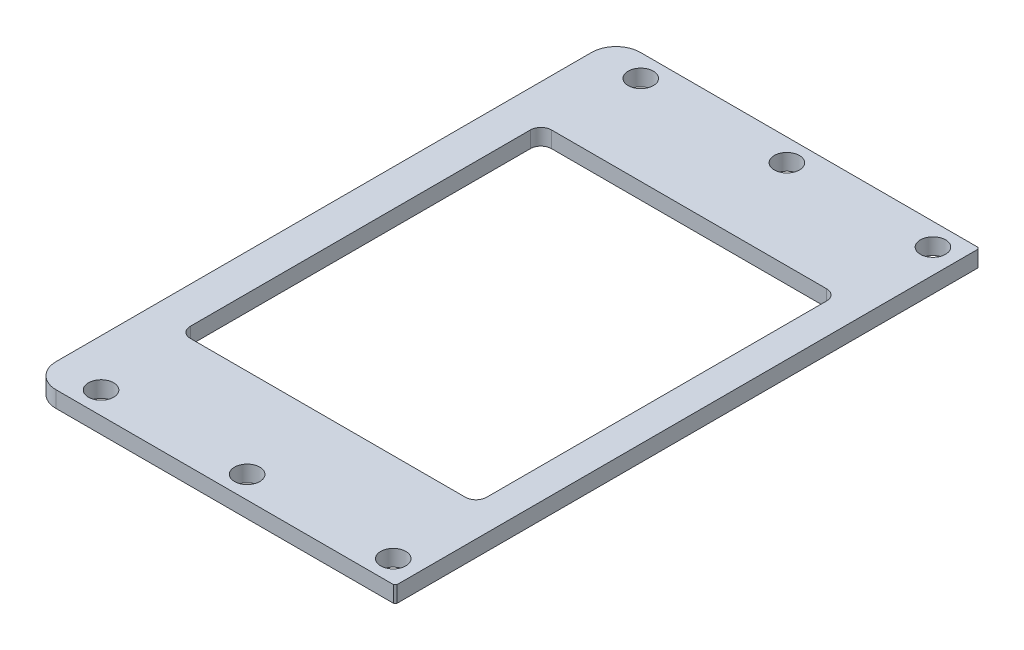
ISO-10303-21;
HEADER;
FILE_DESCRIPTION(('STEP AP214'),'2;1');
FILE_NAME('part.step','',(''),(''),'','','');
FILE_SCHEMA(('AUTOMOTIVE_DESIGN { 1 0 10303 214 1 1 1 1 }'));
ENDSEC;
DATA;
#1=APPLICATION_CONTEXT('core data for automotive mechanical design processes');
#2=APPLICATION_PROTOCOL_DEFINITION('international standard','automotive_design',2000,#1);
#3=PRODUCT_CONTEXT('',#1,'mechanical');
#4=PRODUCT('Part','Part','',(#3));
#5=PRODUCT_RELATED_PRODUCT_CATEGORY('part','',(#4));
#6=PRODUCT_DEFINITION_FORMATION('','',#4);
#7=PRODUCT_DEFINITION_CONTEXT('part definition',#1,'design');
#8=PRODUCT_DEFINITION('design','',#6,#7);
#9=PRODUCT_DEFINITION_SHAPE('','',#8);
#10=(LENGTH_UNIT() NAMED_UNIT(*) SI_UNIT(.MILLI.,.METRE.));
#11=(NAMED_UNIT(*) PLANE_ANGLE_UNIT() SI_UNIT($,.RADIAN.));
#12=(NAMED_UNIT(*) SI_UNIT($,.STERADIAN.) SOLID_ANGLE_UNIT());
#13=UNCERTAINTY_MEASURE_WITH_UNIT(LENGTH_MEASURE(1.E-05),#10,'distance_accuracy_value','');
#14=(GEOMETRIC_REPRESENTATION_CONTEXT(3) GLOBAL_UNCERTAINTY_ASSIGNED_CONTEXT((#13)) GLOBAL_UNIT_ASSIGNED_CONTEXT((#10,
#11,#12)) REPRESENTATION_CONTEXT('',''));
#15=CARTESIAN_POINT('',(0.,0.,0.));
#16=DIRECTION('',(0.,0.,1.));
#17=DIRECTION('',(1.,0.,0.));
#18=AXIS2_PLACEMENT_3D('',#15,#16,#17);
#19=CARTESIAN_POINT('',(-16.6,2.,-20.95));
#20=DIRECTION('',(0.,-1.,0.));
#21=DIRECTION('',(0.,0.,-1.));
#22=AXIS2_PLACEMENT_3D('',#19,#20,#21);
#23=CYLINDRICAL_SURFACE('',#22,1.3);
#24=CARTESIAN_POINT('',(-16.6,0.,-20.95));
#25=DIRECTION('',(0.,1.,0.));
#26=DIRECTION('',(0.,0.,1.));
#27=AXIS2_PLACEMENT_3D('',#24,#25,#26);
#28=CIRCLE('',#27,1.3);
#29=CARTESIAN_POINT('',(-16.6,0.,-22.25));
#30=VERTEX_POINT('',#29);
#31=CARTESIAN_POINT('',(-17.9,0.,-20.95));
#32=VERTEX_POINT('',#31);
#33=EDGE_CURVE('E155',#30,#32,#28,.T.);
#34=ORIENTED_EDGE('',*,*,#33,.F.);
#35=DIRECTION('',(0.,-1.,0.));
#36=VECTOR('',#35,1.);
#37=CARTESIAN_POINT('',(-16.6,2.,-22.25));
#38=LINE('',#37,#36);
#39=CARTESIAN_POINT('',(-16.6,2.,-22.25));
#40=VERTEX_POINT('',#39);
#41=EDGE_CURVE('E151',#40,#30,#38,.T.);
#42=ORIENTED_EDGE('',*,*,#41,.F.);
#43=CARTESIAN_POINT('',(-16.6,2.,-20.95));
#44=DIRECTION('',(0.,1.,0.));
#45=DIRECTION('',(0.,0.,1.));
#46=AXIS2_PLACEMENT_3D('',#43,#44,#45);
#47=CIRCLE('',#46,1.3);
#48=CARTESIAN_POINT('',(-17.9,2.,-20.95));
#49=VERTEX_POINT('',#48);
#50=EDGE_CURVE('E153',#40,#49,#47,.T.);
#51=ORIENTED_EDGE('',*,*,#50,.T.);
#52=DIRECTION('',(0.,-1.,0.));
#53=VECTOR('',#52,1.);
#54=CARTESIAN_POINT('',(-17.9,2.,-20.95));
#55=LINE('',#54,#53);
#56=EDGE_CURVE('E208',#49,#32,#55,.T.);
#57=ORIENTED_EDGE('',*,*,#56,.T.);
#58=EDGE_LOOP('',(#34,#42,#51,#57));
#59=FACE_BOUND('',#58,.T.);
#60=ADVANCED_FACE('F36',(#59),#23,.F.);
#61=CARTESIAN_POINT('',(0.,2.,-22.25));
#62=DIRECTION('',(0.,0.,1.));
#63=DIRECTION('',(1.,0.,0.));
#64=AXIS2_PLACEMENT_3D('',#61,#62,#63);
#65=PLANE('',#64);
#66=DIRECTION('',(-1.,0.,0.));
#67=VECTOR('',#66,1.);
#68=CARTESIAN_POINT('',(0.,0.,-22.25));
#69=LINE('',#68,#67);
#70=CARTESIAN_POINT('',(17.3,0.,-22.25));
#71=VERTEX_POINT('',#70);
#72=EDGE_CURVE('E223',#71,#30,#69,.T.);
#73=ORIENTED_EDGE('',*,*,#72,.F.);
#74=DIRECTION('',(0.,-1.,0.));
#75=VECTOR('',#74,1.);
#76=CARTESIAN_POINT('',(17.3,2.,-22.25));
#77=LINE('',#76,#75);
#78=CARTESIAN_POINT('',(17.3,2.,-22.25));
#79=VERTEX_POINT('',#78);
#80=EDGE_CURVE('E161',#79,#71,#77,.T.);
#81=ORIENTED_EDGE('',*,*,#80,.F.);
#82=DIRECTION('',(-1.,0.,0.));
#83=VECTOR('',#82,1.);
#84=CARTESIAN_POINT('',(0.,2.,-22.25));
#85=LINE('',#84,#83);
#86=EDGE_CURVE('E168',#79,#40,#85,.T.);
#87=ORIENTED_EDGE('',*,*,#86,.T.);
#88=ORIENTED_EDGE('',*,*,#41,.T.);
#89=EDGE_LOOP('',(#73,#81,#87,#88));
#90=FACE_BOUND('',#89,.T.);
#91=ADVANCED_FACE('F175',(#90),#65,.T.);
#92=CARTESIAN_POINT('',(17.3,2.,-20.95));
#93=DIRECTION('',(0.,-1.,0.));
#94=DIRECTION('',(0.,0.,-1.));
#95=AXIS2_PLACEMENT_3D('',#92,#93,#94);
#96=CYLINDRICAL_SURFACE('',#95,1.3);
#97=CARTESIAN_POINT('',(17.3,0.,-20.95));
#98=DIRECTION('',(0.,1.,0.));
#99=DIRECTION('',(0.,0.,1.));
#100=AXIS2_PLACEMENT_3D('',#97,#98,#99);
#101=CIRCLE('',#100,1.3);
#102=CARTESIAN_POINT('',(18.6,0.,-20.95));
#103=VERTEX_POINT('',#102);
#104=EDGE_CURVE('E225',#103,#71,#101,.T.);
#105=ORIENTED_EDGE('',*,*,#104,.F.);
#106=DIRECTION('',(0.,-1.,0.));
#107=VECTOR('',#106,1.);
#108=CARTESIAN_POINT('',(18.6,2.,-20.95));
#109=LINE('',#108,#107);
#110=CARTESIAN_POINT('',(18.6,2.,-20.95));
#111=VERTEX_POINT('',#110);
#112=EDGE_CURVE('E270',#111,#103,#109,.T.);
#113=ORIENTED_EDGE('',*,*,#112,.F.);
#114=CARTESIAN_POINT('',(17.3,2.,-20.95));
#115=DIRECTION('',(0.,1.,0.));
#116=DIRECTION('',(0.,0.,1.));
#117=AXIS2_PLACEMENT_3D('',#114,#115,#116);
#118=CIRCLE('',#117,1.3);
#119=EDGE_CURVE('E176',#111,#79,#118,.T.);
#120=ORIENTED_EDGE('',*,*,#119,.T.);
#121=ORIENTED_EDGE('',*,*,#80,.T.);
#122=EDGE_LOOP('',(#105,#113,#120,#121));
#123=FACE_BOUND('',#122,.T.);
#124=ADVANCED_FACE('F349',(#123),#96,.F.);
#125=CARTESIAN_POINT('',(18.6,2.,0.));
#126=DIRECTION('',(-1.,0.,0.));
#127=DIRECTION('',(0.,0.,1.));
#128=AXIS2_PLACEMENT_3D('',#125,#126,#127);
#129=PLANE('',#128);
#130=DIRECTION('',(0.,0.,-1.));
#131=VECTOR('',#130,1.);
#132=CARTESIAN_POINT('',(18.6,0.,0.));
#133=LINE('',#132,#131);
#134=CARTESIAN_POINT('',(18.6,0.,20.95));
#135=VERTEX_POINT('',#134);
#136=EDGE_CURVE('E228',#135,#103,#133,.T.);
#137=ORIENTED_EDGE('',*,*,#136,.F.);
#138=DIRECTION('',(0.,-1.,0.));
#139=VECTOR('',#138,1.);
#140=CARTESIAN_POINT('',(18.6,2.,20.95));
#141=LINE('',#140,#139);
#142=CARTESIAN_POINT('',(18.6,2.,20.95));
#143=VERTEX_POINT('',#142);
#144=EDGE_CURVE('E268',#143,#135,#141,.T.);
#145=ORIENTED_EDGE('',*,*,#144,.F.);
#146=DIRECTION('',(0.,0.,-1.));
#147=VECTOR('',#146,1.);
#148=CARTESIAN_POINT('',(18.6,2.,0.));
#149=LINE('',#148,#147);
#150=EDGE_CURVE('E178',#143,#111,#149,.T.);
#151=ORIENTED_EDGE('',*,*,#150,.T.);
#152=ORIENTED_EDGE('',*,*,#112,.T.);
#153=EDGE_LOOP('',(#137,#145,#151,#152));
#154=FACE_BOUND('',#153,.T.);
#155=ADVANCED_FACE('F524',(#154),#129,.T.);
#156=CARTESIAN_POINT('',(17.3,2.,20.95));
#157=DIRECTION('',(0.,-1.,0.));
#158=DIRECTION('',(0.,0.,-1.));
#159=AXIS2_PLACEMENT_3D('',#156,#157,#158);
#160=CYLINDRICAL_SURFACE('',#159,1.3);
#161=CARTESIAN_POINT('',(17.3,0.,20.95));
#162=DIRECTION('',(0.,1.,0.));
#163=DIRECTION('',(0.,0.,1.));
#164=AXIS2_PLACEMENT_3D('',#161,#162,#163);
#165=CIRCLE('',#164,1.3);
#166=CARTESIAN_POINT('',(17.3,0.,22.25));
#167=VERTEX_POINT('',#166);
#168=EDGE_CURVE('E231',#167,#135,#165,.T.);
#169=ORIENTED_EDGE('',*,*,#168,.F.);
#170=DIRECTION('',(0.,-1.,0.));
#171=VECTOR('',#170,1.);
#172=CARTESIAN_POINT('',(17.3,2.,22.25));
#173=LINE('',#172,#171);
#174=CARTESIAN_POINT('',(17.3,2.,22.25));
#175=VERTEX_POINT('',#174);
#176=EDGE_CURVE('E266',#175,#167,#173,.T.);
#177=ORIENTED_EDGE('',*,*,#176,.F.);
#178=CARTESIAN_POINT('',(17.3,2.,20.95));
#179=DIRECTION('',(0.,1.,0.));
#180=DIRECTION('',(0.,0.,1.));
#181=AXIS2_PLACEMENT_3D('',#178,#179,#180);
#182=CIRCLE('',#181,1.3);
#183=EDGE_CURVE('E184',#175,#143,#182,.T.);
#184=ORIENTED_EDGE('',*,*,#183,.T.);
#185=ORIENTED_EDGE('',*,*,#144,.T.);
#186=EDGE_LOOP('',(#169,#177,#184,#185));
#187=FACE_BOUND('',#186,.T.);
#188=ADVANCED_FACE('F514',(#187),#160,.F.);
#189=CARTESIAN_POINT('',(0.,2.,22.25));
#190=DIRECTION('',(0.,0.,1.));
#191=DIRECTION('',(1.,0.,0.));
#192=AXIS2_PLACEMENT_3D('',#189,#190,#191);
#193=PLANE('',#192);
#194=DIRECTION('',(-1.,0.,0.));
#195=VECTOR('',#194,1.);
#196=CARTESIAN_POINT('',(0.,0.,22.25));
#197=LINE('',#196,#195);
#198=CARTESIAN_POINT('',(-16.6,0.,22.25));
#199=VERTEX_POINT('',#198);
#200=EDGE_CURVE('E234',#167,#199,#197,.T.);
#201=ORIENTED_EDGE('',*,*,#200,.T.);
#202=DIRECTION('',(0.,-1.,0.));
#203=VECTOR('',#202,1.);
#204=CARTESIAN_POINT('',(-16.6,2.,22.25));
#205=LINE('',#204,#203);
#206=CARTESIAN_POINT('',(-16.6,2.,22.25));
#207=VERTEX_POINT('',#206);
#208=EDGE_CURVE('E263',#207,#199,#205,.T.);
#209=ORIENTED_EDGE('',*,*,#208,.F.);
#210=DIRECTION('',(-1.,0.,0.));
#211=VECTOR('',#210,1.);
#212=CARTESIAN_POINT('',(0.,2.,22.25));
#213=LINE('',#212,#211);
#214=EDGE_CURVE('E187',#175,#207,#213,.T.);
#215=ORIENTED_EDGE('',*,*,#214,.F.);
#216=ORIENTED_EDGE('',*,*,#176,.T.);
#217=EDGE_LOOP('',(#201,#209,#215,#216));
#218=FACE_BOUND('',#217,.T.);
#219=ADVANCED_FACE('F506',(#218),#193,.F.);
#220=CARTESIAN_POINT('',(-16.6,2.,20.95));
#221=DIRECTION('',(0.,-1.,0.));
#222=DIRECTION('',(0.,0.,-1.));
#223=AXIS2_PLACEMENT_3D('',#220,#221,#222);
#224=CYLINDRICAL_SURFACE('',#223,1.3);
#225=CARTESIAN_POINT('',(-16.6,0.,20.95));
#226=DIRECTION('',(0.,1.,0.));
#227=DIRECTION('',(0.,0.,1.));
#228=AXIS2_PLACEMENT_3D('',#225,#226,#227);
#229=CIRCLE('',#228,1.3);
#230=CARTESIAN_POINT('',(-17.9,0.,20.95));
#231=VERTEX_POINT('',#230);
#232=EDGE_CURVE('E237',#199,#231,#229,.F.);
#233=ORIENTED_EDGE('',*,*,#232,.T.);
#234=DIRECTION('',(0.,-1.,0.));
#235=VECTOR('',#234,1.);
#236=CARTESIAN_POINT('',(-17.9,2.,20.95));
#237=LINE('',#236,#235);
#238=CARTESIAN_POINT('',(-17.9,2.,20.95));
#239=VERTEX_POINT('',#238);
#240=EDGE_CURVE('E260',#239,#231,#237,.T.);
#241=ORIENTED_EDGE('',*,*,#240,.F.);
#242=CARTESIAN_POINT('',(-16.6,2.,20.95));
#243=DIRECTION('',(0.,1.,0.));
#244=DIRECTION('',(0.,0.,1.));
#245=AXIS2_PLACEMENT_3D('',#242,#243,#244);
#246=CIRCLE('',#245,1.3);
#247=EDGE_CURVE('E190',#207,#239,#246,.F.);
#248=ORIENTED_EDGE('',*,*,#247,.F.);
#249=ORIENTED_EDGE('',*,*,#208,.T.);
#250=EDGE_LOOP('',(#233,#241,#248,#249));
#251=FACE_BOUND('',#250,.T.);
#252=ADVANCED_FACE('F364',(#251),#224,.F.);
#253=CARTESIAN_POINT('',(0.,2.,36.));
#254=DIRECTION('',(0.,0.,-1.));
#255=DIRECTION('',(-1.,0.,0.));
#256=AXIS2_PLACEMENT_3D('',#253,#254,#255);
#257=PLANE('',#256);
#258=DIRECTION('',(1.,0.,0.));
#259=VECTOR('',#258,1.);
#260=CARTESIAN_POINT('',(0.,2.,36.));
#261=LINE('',#260,#259);
#262=CARTESIAN_POINT('',(-19.4,2.,36.));
#263=VERTEX_POINT('',#262);
#264=CARTESIAN_POINT('',(22.2,2.,36.));
#265=VERTEX_POINT('',#264);
#266=EDGE_CURVE('E338',#263,#265,#261,.T.);
#267=ORIENTED_EDGE('',*,*,#266,.F.);
#268=DIRECTION('',(0.,-1.,0.));
#269=VECTOR('',#268,1.);
#270=CARTESIAN_POINT('',(-19.4,0.,36.));
#271=LINE('',#270,#269);
#272=CARTESIAN_POINT('',(-19.4,0.,36.));
#273=VERTEX_POINT('',#272);
#274=EDGE_CURVE('E11',#263,#273,#271,.T.);
#275=ORIENTED_EDGE('',*,*,#274,.T.);
#276=DIRECTION('',(1.,0.,0.));
#277=VECTOR('',#276,1.);
#278=CARTESIAN_POINT('',(0.,0.,36.));
#279=LINE('',#278,#277);
#280=CARTESIAN_POINT('',(22.2,0.,36.));
#281=VERTEX_POINT('',#280);
#282=EDGE_CURVE('E212',#273,#281,#279,.T.);
#283=ORIENTED_EDGE('',*,*,#282,.T.);
#284=DIRECTION('',(0.,1.,0.));
#285=VECTOR('',#284,1.);
#286=CARTESIAN_POINT('',(22.2,2.,36.));
#287=LINE('',#286,#285);
#288=EDGE_CURVE('E290',#281,#265,#287,.T.);
#289=ORIENTED_EDGE('',*,*,#288,.T.);
#290=EDGE_LOOP('',(#267,#275,#283,#289));
#291=FACE_BOUND('',#290,.T.);
#292=ADVANCED_FACE('F336',(#291),#257,.F.);
#293=CARTESIAN_POINT('',(22.4,2.,0.));
#294=DIRECTION('',(-1.,0.,0.));
#295=DIRECTION('',(0.,0.,1.));
#296=AXIS2_PLACEMENT_3D('',#293,#294,#295);
#297=PLANE('',#296);
#298=DIRECTION('',(0.,0.,-1.));
#299=VECTOR('',#298,1.);
#300=CARTESIAN_POINT('',(22.4,0.,0.));
#301=LINE('',#300,#299);
#302=CARTESIAN_POINT('',(22.4,0.,35.8));
#303=VERTEX_POINT('',#302);
#304=CARTESIAN_POINT('',(22.4,0.,-35.8));
#305=VERTEX_POINT('',#304);
#306=EDGE_CURVE('E214',#303,#305,#301,.T.);
#307=ORIENTED_EDGE('',*,*,#306,.T.);
#308=DIRECTION('',(0.,1.,0.));
#309=VECTOR('',#308,1.);
#310=CARTESIAN_POINT('',(22.4,2.,-35.8));
#311=LINE('',#310,#309);
#312=CARTESIAN_POINT('',(22.4,2.,-35.8));
#313=VERTEX_POINT('',#312);
#314=EDGE_CURVE('E283',#305,#313,#311,.T.);
#315=ORIENTED_EDGE('',*,*,#314,.T.);
#316=DIRECTION('',(0.,0.,-1.));
#317=VECTOR('',#316,1.);
#318=CARTESIAN_POINT('',(22.4,2.,0.));
#319=LINE('',#318,#317);
#320=CARTESIAN_POINT('',(22.4,2.,35.8));
#321=VERTEX_POINT('',#320);
#322=EDGE_CURVE('E329',#321,#313,#319,.T.);
#323=ORIENTED_EDGE('',*,*,#322,.F.);
#324=DIRECTION('',(0.,-1.,0.));
#325=VECTOR('',#324,1.);
#326=CARTESIAN_POINT('',(22.4,2.,35.8));
#327=LINE('',#326,#325);
#328=EDGE_CURVE('E280',#321,#303,#327,.T.);
#329=ORIENTED_EDGE('',*,*,#328,.T.);
#330=EDGE_LOOP('',(#307,#315,#323,#329));
#331=FACE_BOUND('',#330,.T.);
#332=ADVANCED_FACE('F325',(#331),#297,.F.);
#333=CARTESIAN_POINT('',(0.,2.,-36.));
#334=DIRECTION('',(0.,0.,-1.));
#335=DIRECTION('',(-1.,0.,0.));
#336=AXIS2_PLACEMENT_3D('',#333,#334,#335);
#337=PLANE('',#336);
#338=DIRECTION('',(1.,0.,0.));
#339=VECTOR('',#338,1.);
#340=CARTESIAN_POINT('',(0.,0.,-36.));
#341=LINE('',#340,#339);
#342=CARTESIAN_POINT('',(-19.4,0.,-36.));
#343=VERTEX_POINT('',#342);
#344=CARTESIAN_POINT('',(22.2,0.,-36.));
#345=VERTEX_POINT('',#344);
#346=EDGE_CURVE('E217',#343,#345,#341,.T.);
#347=ORIENTED_EDGE('',*,*,#346,.F.);
#348=DIRECTION('',(0.,-1.,0.));
#349=VECTOR('',#348,1.);
#350=CARTESIAN_POINT('',(-19.4,2.,-36.));
#351=LINE('',#350,#349);
#352=CARTESIAN_POINT('',(-19.4,2.,-36.));
#353=VERTEX_POINT('',#352);
#354=EDGE_CURVE('E59',#343,#353,#351,.F.);
#355=ORIENTED_EDGE('',*,*,#354,.T.);
#356=DIRECTION('',(1.,0.,0.));
#357=VECTOR('',#356,1.);
#358=CARTESIAN_POINT('',(0.,2.,-36.));
#359=LINE('',#358,#357);
#360=CARTESIAN_POINT('',(22.2,2.,-36.));
#361=VERTEX_POINT('',#360);
#362=EDGE_CURVE('E305',#353,#361,#359,.T.);
#363=ORIENTED_EDGE('',*,*,#362,.T.);
#364=DIRECTION('',(0.,-1.,0.));
#365=VECTOR('',#364,1.);
#366=CARTESIAN_POINT('',(22.2,0.,-36.));
#367=LINE('',#366,#365);
#368=EDGE_CURVE('E160',#361,#345,#367,.T.);
#369=ORIENTED_EDGE('',*,*,#368,.T.);
#370=EDGE_LOOP('',(#347,#355,#363,#369));
#371=FACE_BOUND('',#370,.T.);
#372=ADVANCED_FACE('F317',(#371),#337,.T.);
#373=CARTESIAN_POINT('',(-16.6,2.,-33.25));
#374=DIRECTION('',(0.,-1.,0.));
#375=DIRECTION('',(0.,0.,-1.));
#376=AXIS2_PLACEMENT_3D('',#373,#374,#375);
#377=CYLINDRICAL_SURFACE('',#376,1.55000000000001);
#378=CARTESIAN_POINT('',(-16.6,2.,-33.25));
#379=DIRECTION('',(0.,1.,0.));
#380=DIRECTION('',(0.,0.,1.));
#381=AXIS2_PLACEMENT_3D('',#378,#379,#380);
#382=CIRCLE('',#381,1.55000000000001);
#383=CARTESIAN_POINT('',(-16.6,2.,-31.7));
#384=VERTEX_POINT('',#383);
#385=EDGE_CURVE('E202',#384,#384,#382,.F.);
#386=ORIENTED_EDGE('',*,*,#385,.F.);
#387=EDGE_LOOP('',(#386));
#388=FACE_BOUND('',#387,.T.);
#389=CARTESIAN_POINT('',(-16.6,0.,-33.25));
#390=DIRECTION('',(0.,1.,0.));
#391=DIRECTION('',(0.,0.,1.));
#392=AXIS2_PLACEMENT_3D('',#389,#390,#391);
#393=CIRCLE('',#392,1.55000000000001);
#394=CARTESIAN_POINT('',(-16.6,0.,-31.7));
#395=VERTEX_POINT('',#394);
#396=EDGE_CURVE('E252',#395,#395,#393,.F.);
#397=ORIENTED_EDGE('',*,*,#396,.T.);
#398=EDGE_LOOP('',(#397));
#399=FACE_BOUND('',#398,.T.);
#400=ADVANCED_FACE('F359',(#388,#399),#377,.F.);
#401=CARTESIAN_POINT('',(19.4,2.,33.25));
#402=DIRECTION('',(0.,-1.,0.));
#403=DIRECTION('',(0.,0.,-1.));
#404=AXIS2_PLACEMENT_3D('',#401,#402,#403);
#405=CYLINDRICAL_SURFACE('',#404,1.55);
#406=CARTESIAN_POINT('',(19.4,2.,33.25));
#407=DIRECTION('',(0.,1.,0.));
#408=DIRECTION('',(0.,0.,1.));
#409=AXIS2_PLACEMENT_3D('',#406,#407,#408);
#410=CIRCLE('',#409,1.55);
#411=CARTESIAN_POINT('',(19.4,2.,34.8));
#412=VERTEX_POINT('',#411);
#413=EDGE_CURVE('E199',#412,#412,#410,.T.);
#414=ORIENTED_EDGE('',*,*,#413,.T.);
#415=EDGE_LOOP('',(#414));
#416=FACE_BOUND('',#415,.T.);
#417=CARTESIAN_POINT('',(19.4,0.,33.25));
#418=DIRECTION('',(0.,1.,0.));
#419=DIRECTION('',(0.,0.,1.));
#420=AXIS2_PLACEMENT_3D('',#417,#418,#419);
#421=CIRCLE('',#420,1.55);
#422=CARTESIAN_POINT('',(19.4,0.,34.8));
#423=VERTEX_POINT('',#422);
#424=EDGE_CURVE('E249',#423,#423,#421,.T.);
#425=ORIENTED_EDGE('',*,*,#424,.F.);
#426=EDGE_LOOP('',(#425));
#427=FACE_BOUND('',#426,.T.);
#428=ADVANCED_FACE('F483',(#416,#427),#405,.F.);
#429=CARTESIAN_POINT('',(1.40000000000001,2.,33.25));
#430=DIRECTION('',(0.,-1.,0.));
#431=DIRECTION('',(0.,0.,-1.));
#432=AXIS2_PLACEMENT_3D('',#429,#430,#431);
#433=CYLINDRICAL_SURFACE('',#432,1.55000000000001);
#434=CARTESIAN_POINT('',(1.40000000000001,2.,33.25));
#435=DIRECTION('',(0.,1.,0.));
#436=DIRECTION('',(0.,0.,1.));
#437=AXIS2_PLACEMENT_3D('',#434,#435,#436);
#438=CIRCLE('',#437,1.55000000000001);
#439=CARTESIAN_POINT('',(1.40000000000001,2.,34.8));
#440=VERTEX_POINT('',#439);
#441=EDGE_CURVE('E196',#440,#440,#438,.T.);
#442=ORIENTED_EDGE('',*,*,#441,.T.);
#443=EDGE_LOOP('',(#442));
#444=FACE_BOUND('',#443,.T.);
#445=CARTESIAN_POINT('',(1.40000000000001,0.,33.25));
#446=DIRECTION('',(0.,1.,0.));
#447=DIRECTION('',(0.,0.,1.));
#448=AXIS2_PLACEMENT_3D('',#445,#446,#447);
#449=CIRCLE('',#448,1.55000000000001);
#450=CARTESIAN_POINT('',(1.40000000000001,0.,34.8));
#451=VERTEX_POINT('',#450);
#452=EDGE_CURVE('E246',#451,#451,#449,.T.);
#453=ORIENTED_EDGE('',*,*,#452,.F.);
#454=EDGE_LOOP('',(#453));
#455=FACE_BOUND('',#454,.T.);
#456=ADVANCED_FACE('F473',(#444,#455),#433,.F.);
#457=CARTESIAN_POINT('',(-16.6,2.,33.25));
#458=DIRECTION('',(0.,-1.,0.));
#459=DIRECTION('',(0.,0.,-1.));
#460=AXIS2_PLACEMENT_3D('',#457,#458,#459);
#461=CYLINDRICAL_SURFACE('',#460,1.55000000000001);
#462=CARTESIAN_POINT('',(-16.6,2.,33.25));
#463=DIRECTION('',(0.,1.,0.));
#464=DIRECTION('',(0.,0.,1.));
#465=AXIS2_PLACEMENT_3D('',#462,#463,#464);
#466=CIRCLE('',#465,1.55000000000001);
#467=CARTESIAN_POINT('',(-16.6,2.,34.8));
#468=VERTEX_POINT('',#467);
#469=EDGE_CURVE('E193',#468,#468,#466,.T.);
#470=ORIENTED_EDGE('',*,*,#469,.T.);
#471=EDGE_LOOP('',(#470));
#472=FACE_BOUND('',#471,.T.);
#473=CARTESIAN_POINT('',(-16.6,0.,33.25));
#474=DIRECTION('',(0.,1.,0.));
#475=DIRECTION('',(0.,0.,1.));
#476=AXIS2_PLACEMENT_3D('',#473,#474,#475);
#477=CIRCLE('',#476,1.55000000000001);
#478=CARTESIAN_POINT('',(-16.6,0.,34.8));
#479=VERTEX_POINT('',#478);
#480=EDGE_CURVE('E243',#479,#479,#477,.T.);
#481=ORIENTED_EDGE('',*,*,#480,.F.);
#482=EDGE_LOOP('',(#481));
#483=FACE_BOUND('',#482,.T.);
#484=ADVANCED_FACE('F463',(#472,#483),#461,.F.);
#485=CARTESIAN_POINT('',(-17.9,2.,0.));
#486=DIRECTION('',(-1.,0.,0.));
#487=DIRECTION('',(0.,0.,1.));
#488=AXIS2_PLACEMENT_3D('',#485,#486,#487);
#489=PLANE('',#488);
#490=DIRECTION('',(0.,0.,-1.));
#491=VECTOR('',#490,1.);
#492=CARTESIAN_POINT('',(-17.9,0.,0.));
#493=LINE('',#492,#491);
#494=EDGE_CURVE('E240',#231,#32,#493,.T.);
#495=ORIENTED_EDGE('',*,*,#494,.T.);
#496=ORIENTED_EDGE('',*,*,#56,.F.);
#497=DIRECTION('',(0.,0.,-1.));
#498=VECTOR('',#497,1.);
#499=CARTESIAN_POINT('',(-17.9,2.,0.));
#500=LINE('',#499,#498);
#501=EDGE_CURVE('E171',#239,#49,#500,.T.);
#502=ORIENTED_EDGE('',*,*,#501,.F.);
#503=ORIENTED_EDGE('',*,*,#240,.T.);
#504=EDGE_LOOP('',(#495,#496,#502,#503));
#505=FACE_BOUND('',#504,.T.);
#506=ADVANCED_FACE('F356',(#505),#489,.F.);
#507=CARTESIAN_POINT('',(-22.4,2.,0.));
#508=DIRECTION('',(-1.,0.,0.));
#509=DIRECTION('',(0.,0.,1.));
#510=AXIS2_PLACEMENT_3D('',#507,#508,#509);
#511=PLANE('',#510);
#512=DIRECTION('',(0.,0.,-1.));
#513=VECTOR('',#512,1.);
#514=CARTESIAN_POINT('',(-22.4,2.,0.));
#515=LINE('',#514,#513);
#516=CARTESIAN_POINT('',(-22.4,2.,33.));
#517=VERTEX_POINT('',#516);
#518=CARTESIAN_POINT('',(-22.4,2.,-33.));
#519=VERTEX_POINT('',#518);
#520=EDGE_CURVE('E173',#517,#519,#515,.T.);
#521=ORIENTED_EDGE('',*,*,#520,.T.);
#522=DIRECTION('',(0.,-1.,0.));
#523=VECTOR('',#522,1.);
#524=CARTESIAN_POINT('',(-22.4,2.,-33.));
#525=LINE('',#524,#523);
#526=CARTESIAN_POINT('',(-22.4,0.,-33.));
#527=VERTEX_POINT('',#526);
#528=EDGE_CURVE('E295',#519,#527,#525,.T.);
#529=ORIENTED_EDGE('',*,*,#528,.T.);
#530=DIRECTION('',(0.,0.,-1.));
#531=VECTOR('',#530,1.);
#532=CARTESIAN_POINT('',(-22.4,0.,0.));
#533=LINE('',#532,#531);
#534=CARTESIAN_POINT('',(-22.4,0.,33.));
#535=VERTEX_POINT('',#534);
#536=EDGE_CURVE('E219',#535,#527,#533,.T.);
#537=ORIENTED_EDGE('',*,*,#536,.F.);
#538=DIRECTION('',(0.,-1.,0.));
#539=VECTOR('',#538,1.);
#540=CARTESIAN_POINT('',(-22.4,2.,33.));
#541=LINE('',#540,#539);
#542=EDGE_CURVE('E293',#535,#517,#541,.F.);
#543=ORIENTED_EDGE('',*,*,#542,.T.);
#544=EDGE_LOOP('',(#521,#529,#537,#543));
#545=FACE_BOUND('',#544,.T.);
#546=ADVANCED_FACE('F309',(#545),#511,.T.);
#547=CARTESIAN_POINT('',(1.40000000000001,2.,-33.25));
#548=DIRECTION('',(0.,-1.,0.));
#549=DIRECTION('',(0.,0.,-1.));
#550=AXIS2_PLACEMENT_3D('',#547,#548,#549);
#551=CYLINDRICAL_SURFACE('',#550,1.55000000000001);
#552=CARTESIAN_POINT('',(1.40000000000001,2.,-33.25));
#553=DIRECTION('',(0.,1.,0.));
#554=DIRECTION('',(0.,0.,1.));
#555=AXIS2_PLACEMENT_3D('',#552,#553,#554);
#556=CIRCLE('',#555,1.55000000000001);
#557=CARTESIAN_POINT('',(1.40000000000001,2.,-31.7));
#558=VERTEX_POINT('',#557);
#559=EDGE_CURVE('E258',#558,#558,#556,.F.);
#560=ORIENTED_EDGE('',*,*,#559,.F.);
#561=EDGE_LOOP('',(#560));
#562=FACE_BOUND('',#561,.T.);
#563=CARTESIAN_POINT('',(1.40000000000001,0.,-33.25));
#564=DIRECTION('',(0.,1.,0.));
#565=DIRECTION('',(0.,0.,1.));
#566=AXIS2_PLACEMENT_3D('',#563,#564,#565);
#567=CIRCLE('',#566,1.55000000000001);
#568=CARTESIAN_POINT('',(1.40000000000001,0.,-31.7));
#569=VERTEX_POINT('',#568);
#570=EDGE_CURVE('E209',#569,#569,#567,.F.);
#571=ORIENTED_EDGE('',*,*,#570,.T.);
#572=EDGE_LOOP('',(#571));
#573=FACE_BOUND('',#572,.T.);
#574=ADVANCED_FACE('F355',(#562,#573),#551,.F.);
#575=CARTESIAN_POINT('',(19.4,2.,-33.25));
#576=DIRECTION('',(0.,-1.,0.));
#577=DIRECTION('',(0.,0.,-1.));
#578=AXIS2_PLACEMENT_3D('',#575,#576,#577);
#579=CYLINDRICAL_SURFACE('',#578,1.55);
#580=CARTESIAN_POINT('',(19.4,2.,-33.25));
#581=DIRECTION('',(0.,1.,0.));
#582=DIRECTION('',(0.,0.,1.));
#583=AXIS2_PLACEMENT_3D('',#580,#581,#582);
#584=CIRCLE('',#583,1.55);
#585=CARTESIAN_POINT('',(19.4,2.,-31.7));
#586=VERTEX_POINT('',#585);
#587=EDGE_CURVE('E205',#586,#586,#584,.F.);
#588=ORIENTED_EDGE('',*,*,#587,.F.);
#589=EDGE_LOOP('',(#588));
#590=FACE_BOUND('',#589,.T.);
#591=CARTESIAN_POINT('',(19.4,0.,-33.25));
#592=DIRECTION('',(0.,1.,0.));
#593=DIRECTION('',(0.,0.,1.));
#594=AXIS2_PLACEMENT_3D('',#591,#592,#593);
#595=CIRCLE('',#594,1.55);
#596=CARTESIAN_POINT('',(19.4,0.,-31.7));
#597=VERTEX_POINT('',#596);
#598=EDGE_CURVE('E255',#597,#597,#595,.F.);
#599=ORIENTED_EDGE('',*,*,#598,.T.);
#600=EDGE_LOOP('',(#599));
#601=FACE_BOUND('',#600,.T.);
#602=ADVANCED_FACE('F367',(#590,#601),#579,.F.);
#603=CARTESIAN_POINT('',(0.,2.,0.));
#604=DIRECTION('',(0.,1.,0.));
#605=DIRECTION('',(0.,0.,1.));
#606=AXIS2_PLACEMENT_3D('',#603,#604,#605);
#607=PLANE('',#606);
#608=ORIENTED_EDGE('',*,*,#559,.T.);
#609=EDGE_LOOP('',(#608));
#610=FACE_BOUND('',#609,.T.);
#611=ORIENTED_EDGE('',*,*,#362,.F.);
#612=CARTESIAN_POINT('',(-19.4,2.,-33.));
#613=DIRECTION('',(0.,1.,0.));
#614=DIRECTION('',(0.,0.,1.));
#615=AXIS2_PLACEMENT_3D('',#612,#613,#614);
#616=CIRCLE('',#615,3.);
#617=EDGE_CURVE('E44',#353,#519,#616,.T.);
#618=ORIENTED_EDGE('',*,*,#617,.T.);
#619=ORIENTED_EDGE('',*,*,#520,.F.);
#620=CARTESIAN_POINT('',(-19.4,2.,33.));
#621=DIRECTION('',(0.,1.,0.));
#622=DIRECTION('',(0.,0.,1.));
#623=AXIS2_PLACEMENT_3D('',#620,#621,#622);
#624=CIRCLE('',#623,3.);
#625=EDGE_CURVE('E51',#517,#263,#624,.T.);
#626=ORIENTED_EDGE('',*,*,#625,.T.);
#627=ORIENTED_EDGE('',*,*,#266,.T.);
#628=DIRECTION('',(-0.707106781186548,0.,0.707106781186548));
#629=VECTOR('',#628,1.);
#630=CARTESIAN_POINT('',(29.1,2.,29.1));
#631=LINE('',#630,#629);
#632=EDGE_CURVE('E285',#265,#321,#631,.F.);
#633=ORIENTED_EDGE('',*,*,#632,.T.);
#634=ORIENTED_EDGE('',*,*,#322,.T.);
#635=DIRECTION('',(-0.707106781186548,0.,-0.707106781186548));
#636=VECTOR('',#635,1.);
#637=CARTESIAN_POINT('',(29.1,2.,-29.1));
#638=LINE('',#637,#636);
#639=EDGE_CURVE('E287',#313,#361,#638,.T.);
#640=ORIENTED_EDGE('',*,*,#639,.T.);
#641=EDGE_LOOP('',(#611,#618,#619,#626,#627,#633,#634,#640));
#642=FACE_BOUND('',#641,.T.);
#643=ORIENTED_EDGE('',*,*,#50,.F.);
#644=ORIENTED_EDGE('',*,*,#86,.F.);
#645=ORIENTED_EDGE('',*,*,#119,.F.);
#646=ORIENTED_EDGE('',*,*,#150,.F.);
#647=ORIENTED_EDGE('',*,*,#183,.F.);
#648=ORIENTED_EDGE('',*,*,#214,.T.);
#649=ORIENTED_EDGE('',*,*,#247,.T.);
#650=ORIENTED_EDGE('',*,*,#501,.T.);
#651=EDGE_LOOP('',(#643,#644,#645,#646,#647,#648,#649,#650));
#652=FACE_BOUND('',#651,.T.);
#653=ORIENTED_EDGE('',*,*,#469,.F.);
#654=EDGE_LOOP('',(#653));
#655=FACE_BOUND('',#654,.T.);
#656=ORIENTED_EDGE('',*,*,#441,.F.);
#657=EDGE_LOOP('',(#656));
#658=FACE_BOUND('',#657,.T.);
#659=ORIENTED_EDGE('',*,*,#413,.F.);
#660=EDGE_LOOP('',(#659));
#661=FACE_BOUND('',#660,.T.);
#662=ORIENTED_EDGE('',*,*,#385,.T.);
#663=EDGE_LOOP('',(#662));
#664=FACE_BOUND('',#663,.T.);
#665=ORIENTED_EDGE('',*,*,#587,.T.);
#666=EDGE_LOOP('',(#665));
#667=FACE_BOUND('',#666,.T.);
#668=ADVANCED_FACE('F165',(#610,#642,#652,#655,#658,#661,#664,#667),#607,.T.);
#669=CARTESIAN_POINT('',(0.,0.,0.));
#670=DIRECTION('',(0.,1.,0.));
#671=DIRECTION('',(0.,0.,1.));
#672=AXIS2_PLACEMENT_3D('',#669,#670,#671);
#673=PLANE('',#672);
#674=ORIENTED_EDGE('',*,*,#570,.F.);
#675=EDGE_LOOP('',(#674));
#676=FACE_BOUND('',#675,.T.);
#677=ORIENTED_EDGE('',*,*,#536,.T.);
#678=CARTESIAN_POINT('',(-19.4,0.,-33.));
#679=DIRECTION('',(0.,1.,0.));
#680=DIRECTION('',(0.,0.,1.));
#681=AXIS2_PLACEMENT_3D('',#678,#679,#680);
#682=CIRCLE('',#681,3.);
#683=EDGE_CURVE('E300',#527,#343,#682,.F.);
#684=ORIENTED_EDGE('',*,*,#683,.T.);
#685=ORIENTED_EDGE('',*,*,#346,.T.);
#686=DIRECTION('',(0.707106781186548,0.,0.707106781186548));
#687=VECTOR('',#686,1.);
#688=CARTESIAN_POINT('',(22.2,0.,-36.));
#689=LINE('',#688,#687);
#690=EDGE_CURVE('E278',#345,#305,#689,.T.);
#691=ORIENTED_EDGE('',*,*,#690,.T.);
#692=ORIENTED_EDGE('',*,*,#306,.F.);
#693=DIRECTION('',(0.707106781186548,0.,-0.707106781186548));
#694=VECTOR('',#693,1.);
#695=CARTESIAN_POINT('',(22.4,0.,35.8));
#696=LINE('',#695,#694);
#697=EDGE_CURVE('E275',#303,#281,#696,.F.);
#698=ORIENTED_EDGE('',*,*,#697,.T.);
#699=ORIENTED_EDGE('',*,*,#282,.F.);
#700=CARTESIAN_POINT('',(-19.4,0.,33.));
#701=DIRECTION('',(0.,1.,0.));
#702=DIRECTION('',(0.,0.,1.));
#703=AXIS2_PLACEMENT_3D('',#700,#701,#702);
#704=CIRCLE('',#703,3.);
#705=EDGE_CURVE('E298',#273,#535,#704,.F.);
#706=ORIENTED_EDGE('',*,*,#705,.T.);
#707=EDGE_LOOP('',(#677,#684,#685,#691,#692,#698,#699,#706));
#708=FACE_BOUND('',#707,.T.);
#709=ORIENTED_EDGE('',*,*,#33,.T.);
#710=ORIENTED_EDGE('',*,*,#494,.F.);
#711=ORIENTED_EDGE('',*,*,#232,.F.);
#712=ORIENTED_EDGE('',*,*,#200,.F.);
#713=ORIENTED_EDGE('',*,*,#168,.T.);
#714=ORIENTED_EDGE('',*,*,#136,.T.);
#715=ORIENTED_EDGE('',*,*,#104,.T.);
#716=ORIENTED_EDGE('',*,*,#72,.T.);
#717=EDGE_LOOP('',(#709,#710,#711,#712,#713,#714,#715,#716));
#718=FACE_BOUND('',#717,.T.);
#719=ORIENTED_EDGE('',*,*,#480,.T.);
#720=EDGE_LOOP('',(#719));
#721=FACE_BOUND('',#720,.T.);
#722=ORIENTED_EDGE('',*,*,#452,.T.);
#723=EDGE_LOOP('',(#722));
#724=FACE_BOUND('',#723,.T.);
#725=ORIENTED_EDGE('',*,*,#424,.T.);
#726=EDGE_LOOP('',(#725));
#727=FACE_BOUND('',#726,.T.);
#728=ORIENTED_EDGE('',*,*,#396,.F.);
#729=EDGE_LOOP('',(#728));
#730=FACE_BOUND('',#729,.T.);
#731=ORIENTED_EDGE('',*,*,#598,.F.);
#732=EDGE_LOOP('',(#731));
#733=FACE_BOUND('',#732,.T.);
#734=ADVANCED_FACE('F314',(#676,#708,#718,#721,#724,#727,#730,#733),#673,.F.);
#735=CARTESIAN_POINT('',(22.2,2.,-36.));
#736=DIRECTION('',(0.707106781186548,0.,-0.707106781186548));
#737=DIRECTION('',(0.,1.,0.));
#738=AXIS2_PLACEMENT_3D('',#735,#736,#737);
#739=PLANE('',#738);
#740=ORIENTED_EDGE('',*,*,#639,.F.);
#741=ORIENTED_EDGE('',*,*,#314,.F.);
#742=ORIENTED_EDGE('',*,*,#690,.F.);
#743=ORIENTED_EDGE('',*,*,#368,.F.);
#744=EDGE_LOOP('',(#740,#741,#742,#743));
#745=FACE_BOUND('',#744,.T.);
#746=ADVANCED_FACE('F321',(#745),#739,.T.);
#747=CARTESIAN_POINT('',(22.4,2.,35.8));
#748=DIRECTION('',(-0.707106781186548,0.,-0.707106781186548));
#749=DIRECTION('',(0.,-1.,0.));
#750=AXIS2_PLACEMENT_3D('',#747,#748,#749);
#751=PLANE('',#750);
#752=ORIENTED_EDGE('',*,*,#632,.F.);
#753=ORIENTED_EDGE('',*,*,#288,.F.);
#754=ORIENTED_EDGE('',*,*,#697,.F.);
#755=ORIENTED_EDGE('',*,*,#328,.F.);
#756=EDGE_LOOP('',(#752,#753,#754,#755));
#757=FACE_BOUND('',#756,.T.);
#758=ADVANCED_FACE('F332',(#757),#751,.F.);
#759=CARTESIAN_POINT('',(-19.4,2.,-33.));
#760=DIRECTION('',(0.,-1.,0.));
#761=DIRECTION('',(0.,0.,-1.));
#762=AXIS2_PLACEMENT_3D('',#759,#760,#761);
#763=CYLINDRICAL_SURFACE('',#762,3.);
#764=ORIENTED_EDGE('',*,*,#617,.F.);
#765=ORIENTED_EDGE('',*,*,#354,.F.);
#766=ORIENTED_EDGE('',*,*,#683,.F.);
#767=ORIENTED_EDGE('',*,*,#528,.F.);
#768=EDGE_LOOP('',(#764,#765,#766,#767));
#769=FACE_BOUND('',#768,.T.);
#770=ADVANCED_FACE('F312',(#769),#763,.T.);
#771=CARTESIAN_POINT('',(-19.4,2.,33.));
#772=DIRECTION('',(0.,1.,0.));
#773=DIRECTION('',(0.,0.,1.));
#774=AXIS2_PLACEMENT_3D('',#771,#772,#773);
#775=CYLINDRICAL_SURFACE('',#774,3.);
#776=ORIENTED_EDGE('',*,*,#625,.F.);
#777=ORIENTED_EDGE('',*,*,#542,.F.);
#778=ORIENTED_EDGE('',*,*,#705,.F.);
#779=ORIENTED_EDGE('',*,*,#274,.F.);
#780=EDGE_LOOP('',(#776,#777,#778,#779));
#781=FACE_BOUND('',#780,.T.);
#782=ADVANCED_FACE('F38',(#781),#775,.T.);
#783=CLOSED_SHELL('',(#60,#91,#124,#155,#188,#219,#252,#292,#332,#372,#400,#428,#456,#484,#506,
#546,#574,#602,#668,#734,#746,#758,#770,#782));
#784=MANIFOLD_SOLID_BREP('B2',#783);
#785=ADVANCED_BREP_SHAPE_REPRESENTATION('',(#18,#784),#14);
#786=SHAPE_DEFINITION_REPRESENTATION(#9,#785);
ENDSEC;
END-ISO-10303-21;
